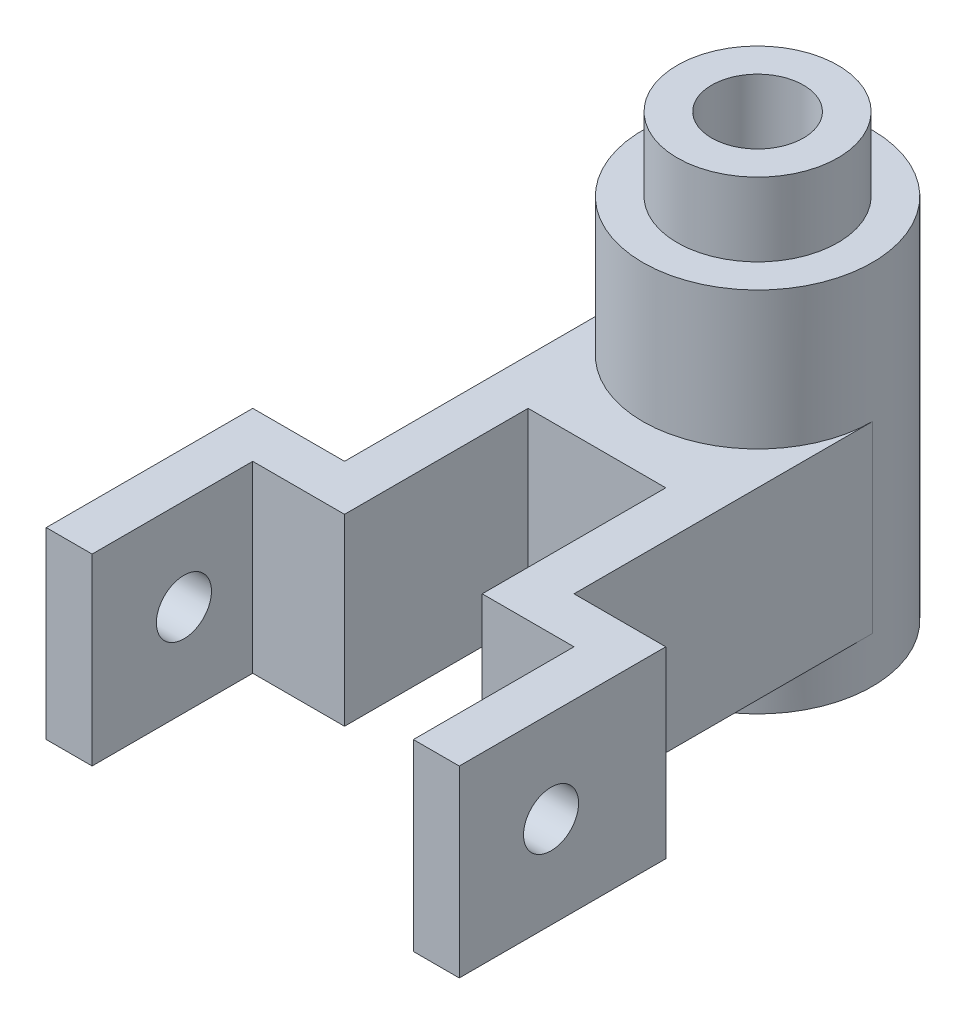
ISO-10303-21;
HEADER;
FILE_DESCRIPTION(('STEP AP214'),'2;1');
FILE_NAME('part.step','',(''),(''),'','','');
FILE_SCHEMA(('AUTOMOTIVE_DESIGN { 1 0 10303 214 1 1 1 1 }'));
ENDSEC;
DATA;
#1=APPLICATION_CONTEXT('core data for automotive mechanical design processes');
#2=APPLICATION_PROTOCOL_DEFINITION('international standard','automotive_design',2000,#1);
#3=PRODUCT_CONTEXT('',#1,'mechanical');
#4=PRODUCT('Part','Part','',(#3));
#5=PRODUCT_RELATED_PRODUCT_CATEGORY('part','',(#4));
#6=PRODUCT_DEFINITION_FORMATION('','',#4);
#7=PRODUCT_DEFINITION_CONTEXT('part definition',#1,'design');
#8=PRODUCT_DEFINITION('design','',#6,#7);
#9=PRODUCT_DEFINITION_SHAPE('','',#8);
#10=(LENGTH_UNIT() NAMED_UNIT(*) SI_UNIT(.MILLI.,.METRE.));
#11=(NAMED_UNIT(*) PLANE_ANGLE_UNIT() SI_UNIT($,.RADIAN.));
#12=(NAMED_UNIT(*) SI_UNIT($,.STERADIAN.) SOLID_ANGLE_UNIT());
#13=UNCERTAINTY_MEASURE_WITH_UNIT(LENGTH_MEASURE(1.E-05),#10,'distance_accuracy_value','');
#14=(GEOMETRIC_REPRESENTATION_CONTEXT(3) GLOBAL_UNCERTAINTY_ASSIGNED_CONTEXT((#13)) GLOBAL_UNIT_ASSIGNED_CONTEXT((#10,
#11,#12)) REPRESENTATION_CONTEXT('',''));
#15=CARTESIAN_POINT('',(0.,0.,0.));
#16=DIRECTION('',(0.,0.,1.));
#17=DIRECTION('',(1.,0.,0.));
#18=AXIS2_PLACEMENT_3D('',#15,#16,#17);
#19=CARTESIAN_POINT('',(0.,80.,0.));
#20=DIRECTION('',(0.,-1.,0.));
#21=DIRECTION('',(0.,0.,-1.));
#22=AXIS2_PLACEMENT_3D('',#19,#20,#21);
#23=CYLINDRICAL_SURFACE('',#22,25.);
#24=DIRECTION('',(0.,-1.,0.));
#25=VECTOR('',#24,1.);
#26=CARTESIAN_POINT('',(-25.,50.,0.));
#27=LINE('',#26,#25);
#28=CARTESIAN_POINT('',(-25.,50.,0.));
#29=VERTEX_POINT('',#28);
#30=CARTESIAN_POINT('',(-25.,9.99999999999999,0.));
#31=VERTEX_POINT('',#30);
#32=EDGE_CURVE('E61',#29,#31,#27,.T.);
#33=ORIENTED_EDGE('',*,*,#32,.F.);
#34=CARTESIAN_POINT('',(0.,50.,0.));
#35=DIRECTION('',(0.,1.,0.));
#36=DIRECTION('',(0.,0.,1.));
#37=AXIS2_PLACEMENT_3D('',#34,#35,#36);
#38=CIRCLE('',#37,25.);
#39=CARTESIAN_POINT('',(25.,50.,0.));
#40=VERTEX_POINT('',#39);
#41=EDGE_CURVE('E56',#29,#40,#38,.T.);
#42=ORIENTED_EDGE('',*,*,#41,.T.);
#43=DIRECTION('',(0.,-1.,0.));
#44=VECTOR('',#43,1.);
#45=CARTESIAN_POINT('',(25.,50.,0.));
#46=LINE('',#45,#44);
#47=CARTESIAN_POINT('',(25.,10.,0.));
#48=VERTEX_POINT('',#47);
#49=EDGE_CURVE('E600',#40,#48,#46,.T.);
#50=ORIENTED_EDGE('',*,*,#49,.T.);
#51=CARTESIAN_POINT('',(0.,10.,0.));
#52=DIRECTION('',(0.,1.,0.));
#53=DIRECTION('',(0.,0.,1.));
#54=AXIS2_PLACEMENT_3D('',#51,#52,#53);
#55=CIRCLE('',#54,25.);
#56=EDGE_CURVE('E534',#31,#48,#55,.T.);
#57=ORIENTED_EDGE('',*,*,#56,.F.);
#58=EDGE_LOOP('',(#33,#42,#50,#57));
#59=FACE_BOUND('',#58,.T.);
#60=CARTESIAN_POINT('',(0.,80.,0.));
#61=DIRECTION('',(0.,1.,0.));
#62=DIRECTION('',(0.,0.,1.));
#63=AXIS2_PLACEMENT_3D('',#60,#61,#62);
#64=CIRCLE('',#63,25.);
#65=CARTESIAN_POINT('',(0.,80.,25.));
#66=VERTEX_POINT('',#65);
#67=EDGE_CURVE('E48',#66,#66,#64,.T.);
#68=ORIENTED_EDGE('',*,*,#67,.F.);
#69=EDGE_LOOP('',(#68));
#70=FACE_BOUND('',#69,.T.);
#71=CARTESIAN_POINT('',(0.,0.,0.));
#72=DIRECTION('',(0.,1.,0.));
#73=DIRECTION('',(0.,0.,1.));
#74=AXIS2_PLACEMENT_3D('',#71,#72,#73);
#75=CIRCLE('',#74,25.);
#76=CARTESIAN_POINT('',(0.,0.,25.));
#77=VERTEX_POINT('',#76);
#78=EDGE_CURVE('E199',#77,#77,#75,.T.);
#79=ORIENTED_EDGE('',*,*,#78,.T.);
#80=EDGE_LOOP('',(#79));
#81=FACE_BOUND('',#80,.T.);
#82=ADVANCED_FACE('F39',(#59,#70,#81),#23,.T.);
#83=CARTESIAN_POINT('',(0.,80.,0.));
#84=DIRECTION('',(0.,1.,0.));
#85=DIRECTION('',(0.,0.,1.));
#86=AXIS2_PLACEMENT_3D('',#83,#84,#85);
#87=PLANE('',#86);
#88=CARTESIAN_POINT('',(0.,80.,0.));
#89=DIRECTION('',(0.,1.,0.));
#90=DIRECTION('',(0.,0.,1.));
#91=AXIS2_PLACEMENT_3D('',#88,#89,#90);
#92=CIRCLE('',#91,17.5);
#93=CARTESIAN_POINT('',(0.,80.,17.5));
#94=VERTEX_POINT('',#93);
#95=EDGE_CURVE('E11',#94,#94,#92,.T.);
#96=ORIENTED_EDGE('',*,*,#95,.F.);
#97=EDGE_LOOP('',(#96));
#98=FACE_BOUND('',#97,.T.);
#99=ORIENTED_EDGE('',*,*,#67,.T.);
#100=EDGE_LOOP('',(#99));
#101=FACE_BOUND('',#100,.T.);
#102=ADVANCED_FACE('F211',(#98,#101),#87,.T.);
#103=CARTESIAN_POINT('',(0.,0.,0.));
#104=DIRECTION('',(0.,1.,0.));
#105=DIRECTION('',(0.,0.,1.));
#106=AXIS2_PLACEMENT_3D('',#103,#104,#105);
#107=PLANE('',#106);
#108=CARTESIAN_POINT('',(0.,0.,0.));
#109=DIRECTION('',(0.,1.,0.));
#110=DIRECTION('',(0.,0.,1.));
#111=AXIS2_PLACEMENT_3D('',#108,#109,#110);
#112=CIRCLE('',#111,10.);
#113=CARTESIAN_POINT('',(0.,0.,10.));
#114=VERTEX_POINT('',#113);
#115=EDGE_CURVE('E187',#114,#114,#112,.T.);
#116=ORIENTED_EDGE('',*,*,#115,.T.);
#117=EDGE_LOOP('',(#116));
#118=FACE_BOUND('',#117,.T.);
#119=ORIENTED_EDGE('',*,*,#78,.F.);
#120=EDGE_LOOP('',(#119));
#121=FACE_BOUND('',#120,.T.);
#122=ADVANCED_FACE('F208',(#118,#121),#107,.F.);
#123=CARTESIAN_POINT('',(0.,96.,0.));
#124=DIRECTION('',(0.,-1.,0.));
#125=DIRECTION('',(0.,0.,-1.));
#126=AXIS2_PLACEMENT_3D('',#123,#124,#125);
#127=CYLINDRICAL_SURFACE('',#126,17.5);
#128=CARTESIAN_POINT('',(0.,96.,0.));
#129=DIRECTION('',(0.,1.,0.));
#130=DIRECTION('',(0.,0.,1.));
#131=AXIS2_PLACEMENT_3D('',#128,#129,#130);
#132=CIRCLE('',#131,17.5);
#133=CARTESIAN_POINT('',(0.,96.,17.5));
#134=VERTEX_POINT('',#133);
#135=EDGE_CURVE('E196',#134,#134,#132,.T.);
#136=ORIENTED_EDGE('',*,*,#135,.F.);
#137=EDGE_LOOP('',(#136));
#138=FACE_BOUND('',#137,.T.);
#139=ORIENTED_EDGE('',*,*,#95,.T.);
#140=EDGE_LOOP('',(#139));
#141=FACE_BOUND('',#140,.T.);
#142=ADVANCED_FACE('F210',(#138,#141),#127,.T.);
#143=CARTESIAN_POINT('',(0.,96.,0.));
#144=DIRECTION('',(0.,1.,0.));
#145=DIRECTION('',(0.,0.,1.));
#146=AXIS2_PLACEMENT_3D('',#143,#144,#145);
#147=PLANE('',#146);
#148=CARTESIAN_POINT('',(0.,96.,0.));
#149=DIRECTION('',(0.,1.,0.));
#150=DIRECTION('',(0.,0.,1.));
#151=AXIS2_PLACEMENT_3D('',#148,#149,#150);
#152=CIRCLE('',#151,10.);
#153=CARTESIAN_POINT('',(0.,96.,10.));
#154=VERTEX_POINT('',#153);
#155=EDGE_CURVE('E182',#154,#154,#152,.T.);
#156=ORIENTED_EDGE('',*,*,#155,.F.);
#157=EDGE_LOOP('',(#156));
#158=FACE_BOUND('',#157,.T.);
#159=ORIENTED_EDGE('',*,*,#135,.T.);
#160=EDGE_LOOP('',(#159));
#161=FACE_BOUND('',#160,.T.);
#162=ADVANCED_FACE('F217',(#158,#161),#147,.T.);
#163=CARTESIAN_POINT('',(0.,-104.,0.));
#164=DIRECTION('',(0.,1.,0.));
#165=DIRECTION('',(0.,0.,1.));
#166=AXIS2_PLACEMENT_3D('',#163,#164,#165);
#167=CYLINDRICAL_SURFACE('',#166,10.);
#168=ORIENTED_EDGE('',*,*,#155,.T.);
#169=EDGE_LOOP('',(#168));
#170=FACE_BOUND('',#169,.T.);
#171=ORIENTED_EDGE('',*,*,#115,.F.);
#172=EDGE_LOOP('',(#171));
#173=FACE_BOUND('',#172,.T.);
#174=ADVANCED_FACE('F252',(#170,#173),#167,.F.);
#175=CARTESIAN_POINT('',(15.,50.,75.));
#176=DIRECTION('',(0.,0.,-1.));
#177=DIRECTION('',(-1.,0.,0.));
#178=AXIS2_PLACEMENT_3D('',#175,#176,#177);
#179=PLANE('',#178);
#180=DIRECTION('',(1.,0.,0.));
#181=VECTOR('',#180,1.);
#182=CARTESIAN_POINT('',(15.,10.,75.));
#183=LINE('',#182,#181);
#184=CARTESIAN_POINT('',(15.,10.,75.));
#185=VERTEX_POINT('',#184);
#186=CARTESIAN_POINT('',(35.,10.,75.));
#187=VERTEX_POINT('',#186);
#188=EDGE_CURVE('E180',#185,#187,#183,.T.);
#189=ORIENTED_EDGE('',*,*,#188,.T.);
#190=DIRECTION('',(0.,-1.,0.));
#191=VECTOR('',#190,1.);
#192=CARTESIAN_POINT('',(35.,50.,75.));
#193=LINE('',#192,#191);
#194=CARTESIAN_POINT('',(35.,50.,75.));
#195=VERTEX_POINT('',#194);
#196=EDGE_CURVE('E158',#195,#187,#193,.T.);
#197=ORIENTED_EDGE('',*,*,#196,.F.);
#198=DIRECTION('',(1.,0.,0.));
#199=VECTOR('',#198,1.);
#200=CARTESIAN_POINT('',(15.,50.,75.));
#201=LINE('',#200,#199);
#202=CARTESIAN_POINT('',(15.,50.,75.));
#203=VERTEX_POINT('',#202);
#204=EDGE_CURVE('E166',#203,#195,#201,.T.);
#205=ORIENTED_EDGE('',*,*,#204,.F.);
#206=DIRECTION('',(0.,-1.,0.));
#207=VECTOR('',#206,1.);
#208=CARTESIAN_POINT('',(15.,50.,75.));
#209=LINE('',#208,#207);
#210=EDGE_CURVE('E514',#203,#185,#209,.T.);
#211=ORIENTED_EDGE('',*,*,#210,.T.);
#212=EDGE_LOOP('',(#189,#197,#205,#211));
#213=FACE_BOUND('',#212,.T.);
#214=ADVANCED_FACE('F178',(#213),#179,.F.);
#215=CARTESIAN_POINT('',(35.,50.,75.));
#216=DIRECTION('',(1.,0.,0.));
#217=DIRECTION('',(0.,0.,-1.));
#218=AXIS2_PLACEMENT_3D('',#215,#216,#217);
#219=PLANE('',#218);
#220=CARTESIAN_POINT('',(35.,30.,90.));
#221=DIRECTION('',(1.,0.,0.));
#222=DIRECTION('',(0.,0.,-1.));
#223=AXIS2_PLACEMENT_3D('',#220,#221,#222);
#224=CIRCLE('',#223,5.99999999999999);
#225=CARTESIAN_POINT('',(35.,30.,84.));
#226=VERTEX_POINT('',#225);
#227=EDGE_CURVE('E458',#226,#226,#224,.T.);
#228=ORIENTED_EDGE('',*,*,#227,.T.);
#229=EDGE_LOOP('',(#228));
#230=FACE_BOUND('',#229,.T.);
#231=DIRECTION('',(0.,0.,1.));
#232=VECTOR('',#231,1.);
#233=CARTESIAN_POINT('',(35.,10.,75.));
#234=LINE('',#233,#232);
#235=CARTESIAN_POINT('',(35.,10.,110.));
#236=VERTEX_POINT('',#235);
#237=EDGE_CURVE('E464',#187,#236,#234,.T.);
#238=ORIENTED_EDGE('',*,*,#237,.T.);
#239=DIRECTION('',(0.,-1.,0.));
#240=VECTOR('',#239,1.);
#241=CARTESIAN_POINT('',(35.,50.,110.));
#242=LINE('',#241,#240);
#243=CARTESIAN_POINT('',(35.,50.,110.));
#244=VERTEX_POINT('',#243);
#245=EDGE_CURVE('E160',#244,#236,#242,.T.);
#246=ORIENTED_EDGE('',*,*,#245,.F.);
#247=DIRECTION('',(0.,0.,1.));
#248=VECTOR('',#247,1.);
#249=CARTESIAN_POINT('',(35.,50.,75.));
#250=LINE('',#249,#248);
#251=EDGE_CURVE('E153',#195,#244,#250,.T.);
#252=ORIENTED_EDGE('',*,*,#251,.F.);
#253=ORIENTED_EDGE('',*,*,#196,.T.);
#254=EDGE_LOOP('',(#238,#246,#252,#253));
#255=FACE_BOUND('',#254,.T.);
#256=ADVANCED_FACE('F156',(#230,#255),#219,.F.);
#257=CARTESIAN_POINT('',(45.,50.,110.));
#258=DIRECTION('',(0.,0.,1.));
#259=DIRECTION('',(1.,0.,0.));
#260=AXIS2_PLACEMENT_3D('',#257,#258,#259);
#261=PLANE('',#260);
#262=DIRECTION('',(-1.,0.,0.));
#263=VECTOR('',#262,1.);
#264=CARTESIAN_POINT('',(45.,10.,110.));
#265=LINE('',#264,#263);
#266=CARTESIAN_POINT('',(45.,10.,110.));
#267=VERTEX_POINT('',#266);
#268=EDGE_CURVE('E518',#267,#236,#265,.T.);
#269=ORIENTED_EDGE('',*,*,#268,.F.);
#270=DIRECTION('',(0.,-1.,0.));
#271=VECTOR('',#270,1.);
#272=CARTESIAN_POINT('',(45.,50.,110.));
#273=LINE('',#272,#271);
#274=CARTESIAN_POINT('',(45.,50.,110.));
#275=VERTEX_POINT('',#274);
#276=EDGE_CURVE('E189',#275,#267,#273,.T.);
#277=ORIENTED_EDGE('',*,*,#276,.F.);
#278=DIRECTION('',(-1.,0.,0.));
#279=VECTOR('',#278,1.);
#280=CARTESIAN_POINT('',(45.,50.,110.));
#281=LINE('',#280,#279);
#282=EDGE_CURVE('E165',#275,#244,#281,.T.);
#283=ORIENTED_EDGE('',*,*,#282,.T.);
#284=ORIENTED_EDGE('',*,*,#245,.T.);
#285=EDGE_LOOP('',(#269,#277,#283,#284));
#286=FACE_BOUND('',#285,.T.);
#287=ADVANCED_FACE('F276',(#286),#261,.T.);
#288=CARTESIAN_POINT('',(45.,50.,65.));
#289=DIRECTION('',(1.,0.,0.));
#290=DIRECTION('',(0.,0.,-1.));
#291=AXIS2_PLACEMENT_3D('',#288,#289,#290);
#292=PLANE('',#291);
#293=CARTESIAN_POINT('',(45.,30.,90.));
#294=DIRECTION('',(1.,0.,0.));
#295=DIRECTION('',(0.,0.,-1.));
#296=AXIS2_PLACEMENT_3D('',#293,#294,#295);
#297=CIRCLE('',#296,5.99999999999999);
#298=CARTESIAN_POINT('',(45.,30.,84.));
#299=VERTEX_POINT('',#298);
#300=EDGE_CURVE('E455',#299,#299,#297,.T.);
#301=ORIENTED_EDGE('',*,*,#300,.F.);
#302=EDGE_LOOP('',(#301));
#303=FACE_BOUND('',#302,.T.);
#304=DIRECTION('',(0.,0.,1.));
#305=VECTOR('',#304,1.);
#306=CARTESIAN_POINT('',(45.,10.,65.));
#307=LINE('',#306,#305);
#308=CARTESIAN_POINT('',(45.,10.,65.));
#309=VERTEX_POINT('',#308);
#310=EDGE_CURVE('E522',#309,#267,#307,.T.);
#311=ORIENTED_EDGE('',*,*,#310,.F.);
#312=DIRECTION('',(0.,-1.,0.));
#313=VECTOR('',#312,1.);
#314=CARTESIAN_POINT('',(45.,50.,65.));
#315=LINE('',#314,#313);
#316=CARTESIAN_POINT('',(45.,50.,65.));
#317=VERTEX_POINT('',#316);
#318=EDGE_CURVE('E606',#317,#309,#315,.T.);
#319=ORIENTED_EDGE('',*,*,#318,.F.);
#320=DIRECTION('',(0.,0.,1.));
#321=VECTOR('',#320,1.);
#322=CARTESIAN_POINT('',(45.,50.,65.));
#323=LINE('',#322,#321);
#324=EDGE_CURVE('E472',#317,#275,#323,.T.);
#325=ORIENTED_EDGE('',*,*,#324,.T.);
#326=ORIENTED_EDGE('',*,*,#276,.T.);
#327=EDGE_LOOP('',(#311,#319,#325,#326));
#328=FACE_BOUND('',#327,.T.);
#329=ADVANCED_FACE('F285',(#303,#328),#292,.T.);
#330=CARTESIAN_POINT('',(25.,50.,65.));
#331=DIRECTION('',(0.,0.,-1.));
#332=DIRECTION('',(-1.,0.,0.));
#333=AXIS2_PLACEMENT_3D('',#330,#331,#332);
#334=PLANE('',#333);
#335=DIRECTION('',(1.,0.,0.));
#336=VECTOR('',#335,1.);
#337=CARTESIAN_POINT('',(25.,10.,65.));
#338=LINE('',#337,#336);
#339=CARTESIAN_POINT('',(25.,10.,65.));
#340=VERTEX_POINT('',#339);
#341=EDGE_CURVE('E526',#340,#309,#338,.T.);
#342=ORIENTED_EDGE('',*,*,#341,.F.);
#343=DIRECTION('',(0.,-1.,0.));
#344=VECTOR('',#343,1.);
#345=CARTESIAN_POINT('',(25.,50.,65.));
#346=LINE('',#345,#344);
#347=CARTESIAN_POINT('',(25.,50.,65.));
#348=VERTEX_POINT('',#347);
#349=EDGE_CURVE('E603',#348,#340,#346,.T.);
#350=ORIENTED_EDGE('',*,*,#349,.F.);
#351=DIRECTION('',(1.,0.,0.));
#352=VECTOR('',#351,1.);
#353=CARTESIAN_POINT('',(25.,50.,65.));
#354=LINE('',#353,#352);
#355=EDGE_CURVE('E476',#348,#317,#354,.T.);
#356=ORIENTED_EDGE('',*,*,#355,.T.);
#357=ORIENTED_EDGE('',*,*,#318,.T.);
#358=EDGE_LOOP('',(#342,#350,#356,#357));
#359=FACE_BOUND('',#358,.T.);
#360=ADVANCED_FACE('F293',(#359),#334,.T.);
#361=CARTESIAN_POINT('',(25.,50.,0.));
#362=DIRECTION('',(1.,0.,0.));
#363=DIRECTION('',(0.,0.,-1.));
#364=AXIS2_PLACEMENT_3D('',#361,#362,#363);
#365=PLANE('',#364);
#366=DIRECTION('',(0.,0.,1.));
#367=VECTOR('',#366,1.);
#368=CARTESIAN_POINT('',(25.,10.,0.));
#369=LINE('',#368,#367);
#370=EDGE_CURVE('E530',#48,#340,#369,.T.);
#371=ORIENTED_EDGE('',*,*,#370,.F.);
#372=ORIENTED_EDGE('',*,*,#49,.F.);
#373=DIRECTION('',(0.,0.,1.));
#374=VECTOR('',#373,1.);
#375=CARTESIAN_POINT('',(25.,50.,0.));
#376=LINE('',#375,#374);
#377=EDGE_CURVE('E480',#40,#348,#376,.T.);
#378=ORIENTED_EDGE('',*,*,#377,.T.);
#379=ORIENTED_EDGE('',*,*,#349,.T.);
#380=EDGE_LOOP('',(#371,#372,#378,#379));
#381=FACE_BOUND('',#380,.T.);
#382=ADVANCED_FACE('F301',(#381),#365,.T.);
#383=CARTESIAN_POINT('',(-25.,50.,0.));
#384=DIRECTION('',(1.,0.,0.));
#385=DIRECTION('',(0.,0.,-1.));
#386=AXIS2_PLACEMENT_3D('',#383,#384,#385);
#387=PLANE('',#386);
#388=DIRECTION('',(0.,0.,1.));
#389=VECTOR('',#388,1.);
#390=CARTESIAN_POINT('',(-25.,10.,0.));
#391=LINE('',#390,#389);
#392=CARTESIAN_POINT('',(-25.,10.,65.));
#393=VERTEX_POINT('',#392);
#394=EDGE_CURVE('E538',#31,#393,#391,.T.);
#395=ORIENTED_EDGE('',*,*,#394,.T.);
#396=DIRECTION('',(0.,-1.,0.));
#397=VECTOR('',#396,1.);
#398=CARTESIAN_POINT('',(-25.,50.,65.));
#399=LINE('',#398,#397);
#400=CARTESIAN_POINT('',(-25.,50.,65.));
#401=VERTEX_POINT('',#400);
#402=EDGE_CURVE('E594',#401,#393,#399,.T.);
#403=ORIENTED_EDGE('',*,*,#402,.F.);
#404=DIRECTION('',(0.,0.,1.));
#405=VECTOR('',#404,1.);
#406=CARTESIAN_POINT('',(-25.,50.,0.));
#407=LINE('',#406,#405);
#408=EDGE_CURVE('E486',#29,#401,#407,.T.);
#409=ORIENTED_EDGE('',*,*,#408,.F.);
#410=ORIENTED_EDGE('',*,*,#32,.T.);
#411=EDGE_LOOP('',(#395,#403,#409,#410));
#412=FACE_BOUND('',#411,.T.);
#413=ADVANCED_FACE('F309',(#412),#387,.F.);
#414=CARTESIAN_POINT('',(-25.,50.,65.));
#415=DIRECTION('',(0.,0.,1.));
#416=DIRECTION('',(1.,0.,0.));
#417=AXIS2_PLACEMENT_3D('',#414,#415,#416);
#418=PLANE('',#417);
#419=DIRECTION('',(-1.,0.,0.));
#420=VECTOR('',#419,1.);
#421=CARTESIAN_POINT('',(-25.,10.,65.));
#422=LINE('',#421,#420);
#423=CARTESIAN_POINT('',(-45.,10.,65.));
#424=VERTEX_POINT('',#423);
#425=EDGE_CURVE('E541',#393,#424,#422,.T.);
#426=ORIENTED_EDGE('',*,*,#425,.T.);
#427=DIRECTION('',(0.,-1.,0.));
#428=VECTOR('',#427,1.);
#429=CARTESIAN_POINT('',(-45.,50.,65.));
#430=LINE('',#429,#428);
#431=CARTESIAN_POINT('',(-45.,50.,65.));
#432=VERTEX_POINT('',#431);
#433=EDGE_CURVE('E590',#432,#424,#430,.T.);
#434=ORIENTED_EDGE('',*,*,#433,.F.);
#435=DIRECTION('',(-1.,0.,0.));
#436=VECTOR('',#435,1.);
#437=CARTESIAN_POINT('',(-25.,50.,65.));
#438=LINE('',#437,#436);
#439=EDGE_CURVE('E489',#401,#432,#438,.T.);
#440=ORIENTED_EDGE('',*,*,#439,.F.);
#441=ORIENTED_EDGE('',*,*,#402,.T.);
#442=EDGE_LOOP('',(#426,#434,#440,#441));
#443=FACE_BOUND('',#442,.T.);
#444=ADVANCED_FACE('F317',(#443),#418,.F.);
#445=CARTESIAN_POINT('',(-45.,50.,65.));
#446=DIRECTION('',(1.,0.,0.));
#447=DIRECTION('',(0.,0.,-1.));
#448=AXIS2_PLACEMENT_3D('',#445,#446,#447);
#449=PLANE('',#448);
#450=CARTESIAN_POINT('',(-45.,30.,90.));
#451=DIRECTION('',(1.,0.,0.));
#452=DIRECTION('',(0.,0.,-1.));
#453=AXIS2_PLACEMENT_3D('',#450,#451,#452);
#454=CIRCLE('',#453,5.99999999999999);
#455=CARTESIAN_POINT('',(-45.,30.,84.));
#456=VERTEX_POINT('',#455);
#457=EDGE_CURVE('E460',#456,#456,#454,.T.);
#458=ORIENTED_EDGE('',*,*,#457,.T.);
#459=EDGE_LOOP('',(#458));
#460=FACE_BOUND('',#459,.T.);
#461=DIRECTION('',(0.,0.,1.));
#462=VECTOR('',#461,1.);
#463=CARTESIAN_POINT('',(-45.,10.,65.));
#464=LINE('',#463,#462);
#465=CARTESIAN_POINT('',(-45.,10.,110.));
#466=VERTEX_POINT('',#465);
#467=EDGE_CURVE('E544',#424,#466,#464,.T.);
#468=ORIENTED_EDGE('',*,*,#467,.T.);
#469=DIRECTION('',(0.,-1.,0.));
#470=VECTOR('',#469,1.);
#471=CARTESIAN_POINT('',(-45.,50.,110.));
#472=LINE('',#471,#470);
#473=CARTESIAN_POINT('',(-45.,50.,110.));
#474=VERTEX_POINT('',#473);
#475=EDGE_CURVE('E586',#474,#466,#472,.T.);
#476=ORIENTED_EDGE('',*,*,#475,.F.);
#477=DIRECTION('',(0.,0.,1.));
#478=VECTOR('',#477,1.);
#479=CARTESIAN_POINT('',(-45.,50.,65.));
#480=LINE('',#479,#478);
#481=EDGE_CURVE('E492',#432,#474,#480,.T.);
#482=ORIENTED_EDGE('',*,*,#481,.F.);
#483=ORIENTED_EDGE('',*,*,#433,.T.);
#484=EDGE_LOOP('',(#468,#476,#482,#483));
#485=FACE_BOUND('',#484,.T.);
#486=ADVANCED_FACE('F325',(#460,#485),#449,.F.);
#487=CARTESIAN_POINT('',(-45.,50.,110.));
#488=DIRECTION('',(0.,0.,-1.));
#489=DIRECTION('',(-1.,0.,0.));
#490=AXIS2_PLACEMENT_3D('',#487,#488,#489);
#491=PLANE('',#490);
#492=DIRECTION('',(1.,0.,0.));
#493=VECTOR('',#492,1.);
#494=CARTESIAN_POINT('',(-45.,10.,110.));
#495=LINE('',#494,#493);
#496=CARTESIAN_POINT('',(-35.,10.,110.));
#497=VERTEX_POINT('',#496);
#498=EDGE_CURVE('E547',#466,#497,#495,.T.);
#499=ORIENTED_EDGE('',*,*,#498,.T.);
#500=DIRECTION('',(0.,-1.,0.));
#501=VECTOR('',#500,1.);
#502=CARTESIAN_POINT('',(-35.,50.,110.));
#503=LINE('',#502,#501);
#504=CARTESIAN_POINT('',(-35.,50.,110.));
#505=VERTEX_POINT('',#504);
#506=EDGE_CURVE('E583',#505,#497,#503,.T.);
#507=ORIENTED_EDGE('',*,*,#506,.F.);
#508=DIRECTION('',(1.,0.,0.));
#509=VECTOR('',#508,1.);
#510=CARTESIAN_POINT('',(-45.,50.,110.));
#511=LINE('',#510,#509);
#512=EDGE_CURVE('E495',#474,#505,#511,.T.);
#513=ORIENTED_EDGE('',*,*,#512,.F.);
#514=ORIENTED_EDGE('',*,*,#475,.T.);
#515=EDGE_LOOP('',(#499,#507,#513,#514));
#516=FACE_BOUND('',#515,.T.);
#517=ADVANCED_FACE('F333',(#516),#491,.F.);
#518=CARTESIAN_POINT('',(-35.,50.,75.));
#519=DIRECTION('',(1.,0.,0.));
#520=DIRECTION('',(0.,0.,-1.));
#521=AXIS2_PLACEMENT_3D('',#518,#519,#520);
#522=PLANE('',#521);
#523=CARTESIAN_POINT('',(-35.,30.,90.));
#524=DIRECTION('',(1.,0.,0.));
#525=DIRECTION('',(0.,0.,-1.));
#526=AXIS2_PLACEMENT_3D('',#523,#524,#525);
#527=CIRCLE('',#526,5.99999999999999);
#528=CARTESIAN_POINT('',(-35.,30.,84.));
#529=VERTEX_POINT('',#528);
#530=EDGE_CURVE('E42',#529,#529,#527,.T.);
#531=ORIENTED_EDGE('',*,*,#530,.F.);
#532=EDGE_LOOP('',(#531));
#533=FACE_BOUND('',#532,.T.);
#534=DIRECTION('',(0.,0.,1.));
#535=VECTOR('',#534,1.);
#536=CARTESIAN_POINT('',(-35.,10.,75.));
#537=LINE('',#536,#535);
#538=CARTESIAN_POINT('',(-35.,10.,75.));
#539=VERTEX_POINT('',#538);
#540=EDGE_CURVE('E551',#539,#497,#537,.T.);
#541=ORIENTED_EDGE('',*,*,#540,.F.);
#542=DIRECTION('',(0.,-1.,0.));
#543=VECTOR('',#542,1.);
#544=CARTESIAN_POINT('',(-35.,50.,75.));
#545=LINE('',#544,#543);
#546=CARTESIAN_POINT('',(-35.,50.,75.));
#547=VERTEX_POINT('',#546);
#548=EDGE_CURVE('E580',#547,#539,#545,.T.);
#549=ORIENTED_EDGE('',*,*,#548,.F.);
#550=DIRECTION('',(0.,0.,1.));
#551=VECTOR('',#550,1.);
#552=CARTESIAN_POINT('',(-35.,50.,75.));
#553=LINE('',#552,#551);
#554=EDGE_CURVE('E498',#547,#505,#553,.T.);
#555=ORIENTED_EDGE('',*,*,#554,.T.);
#556=ORIENTED_EDGE('',*,*,#506,.T.);
#557=EDGE_LOOP('',(#541,#549,#555,#556));
#558=FACE_BOUND('',#557,.T.);
#559=ADVANCED_FACE('F341',(#533,#558),#522,.T.);
#560=CARTESIAN_POINT('',(-15.,50.,75.));
#561=DIRECTION('',(0.,0.,1.));
#562=DIRECTION('',(1.,0.,0.));
#563=AXIS2_PLACEMENT_3D('',#560,#561,#562);
#564=PLANE('',#563);
#565=DIRECTION('',(-1.,0.,0.));
#566=VECTOR('',#565,1.);
#567=CARTESIAN_POINT('',(-15.,10.,75.));
#568=LINE('',#567,#566);
#569=CARTESIAN_POINT('',(-15.,10.,75.));
#570=VERTEX_POINT('',#569);
#571=EDGE_CURVE('E555',#570,#539,#568,.T.);
#572=ORIENTED_EDGE('',*,*,#571,.F.);
#573=DIRECTION('',(0.,-1.,0.));
#574=VECTOR('',#573,1.);
#575=CARTESIAN_POINT('',(-15.,50.,75.));
#576=LINE('',#575,#574);
#577=CARTESIAN_POINT('',(-15.,50.,75.));
#578=VERTEX_POINT('',#577);
#579=EDGE_CURVE('E577',#578,#570,#576,.T.);
#580=ORIENTED_EDGE('',*,*,#579,.F.);
#581=DIRECTION('',(-1.,0.,0.));
#582=VECTOR('',#581,1.);
#583=CARTESIAN_POINT('',(-15.,50.,75.));
#584=LINE('',#583,#582);
#585=EDGE_CURVE('E502',#578,#547,#584,.T.);
#586=ORIENTED_EDGE('',*,*,#585,.T.);
#587=ORIENTED_EDGE('',*,*,#548,.T.);
#588=EDGE_LOOP('',(#572,#580,#586,#587));
#589=FACE_BOUND('',#588,.T.);
#590=ADVANCED_FACE('F349',(#589),#564,.T.);
#591=CARTESIAN_POINT('',(-15.,50.,35.));
#592=DIRECTION('',(1.,0.,0.));
#593=DIRECTION('',(0.,0.,-1.));
#594=AXIS2_PLACEMENT_3D('',#591,#592,#593);
#595=PLANE('',#594);
#596=DIRECTION('',(0.,0.,1.));
#597=VECTOR('',#596,1.);
#598=CARTESIAN_POINT('',(-15.,10.,35.));
#599=LINE('',#598,#597);
#600=CARTESIAN_POINT('',(-15.,10.,35.));
#601=VERTEX_POINT('',#600);
#602=EDGE_CURVE('E559',#601,#570,#599,.T.);
#603=ORIENTED_EDGE('',*,*,#602,.F.);
#604=DIRECTION('',(0.,-1.,0.));
#605=VECTOR('',#604,1.);
#606=CARTESIAN_POINT('',(-15.,50.,35.));
#607=LINE('',#606,#605);
#608=CARTESIAN_POINT('',(-15.,50.,35.));
#609=VERTEX_POINT('',#608);
#610=EDGE_CURVE('E573',#609,#601,#607,.T.);
#611=ORIENTED_EDGE('',*,*,#610,.F.);
#612=DIRECTION('',(0.,0.,1.));
#613=VECTOR('',#612,1.);
#614=CARTESIAN_POINT('',(-15.,50.,35.));
#615=LINE('',#614,#613);
#616=EDGE_CURVE('E506',#609,#578,#615,.T.);
#617=ORIENTED_EDGE('',*,*,#616,.T.);
#618=ORIENTED_EDGE('',*,*,#579,.T.);
#619=EDGE_LOOP('',(#603,#611,#617,#618));
#620=FACE_BOUND('',#619,.T.);
#621=ADVANCED_FACE('F357',(#620),#595,.T.);
#622=CARTESIAN_POINT('',(15.,50.,35.));
#623=DIRECTION('',(0.,0.,1.));
#624=DIRECTION('',(1.,0.,0.));
#625=AXIS2_PLACEMENT_3D('',#622,#623,#624);
#626=PLANE('',#625);
#627=DIRECTION('',(-1.,0.,0.));
#628=VECTOR('',#627,1.);
#629=CARTESIAN_POINT('',(15.,10.,35.));
#630=LINE('',#629,#628);
#631=CARTESIAN_POINT('',(15.,10.,35.));
#632=VERTEX_POINT('',#631);
#633=EDGE_CURVE('E563',#632,#601,#630,.T.);
#634=ORIENTED_EDGE('',*,*,#633,.F.);
#635=DIRECTION('',(0.,-1.,0.));
#636=VECTOR('',#635,1.);
#637=CARTESIAN_POINT('',(15.,50.,35.));
#638=LINE('',#637,#636);
#639=CARTESIAN_POINT('',(15.,50.,35.));
#640=VERTEX_POINT('',#639);
#641=EDGE_CURVE('E570',#640,#632,#638,.T.);
#642=ORIENTED_EDGE('',*,*,#641,.F.);
#643=DIRECTION('',(1.,0.,0.));
#644=VECTOR('',#643,1.);
#645=CARTESIAN_POINT('',(-15.,50.,35.));
#646=LINE('',#645,#644);
#647=EDGE_CURVE('E510',#609,#640,#646,.T.);
#648=ORIENTED_EDGE('',*,*,#647,.F.);
#649=ORIENTED_EDGE('',*,*,#610,.T.);
#650=EDGE_LOOP('',(#634,#642,#648,#649));
#651=FACE_BOUND('',#650,.T.);
#652=ADVANCED_FACE('F365',(#651),#626,.T.);
#653=CARTESIAN_POINT('',(15.,50.,35.));
#654=DIRECTION('',(1.,0.,0.));
#655=DIRECTION('',(0.,0.,-1.));
#656=AXIS2_PLACEMENT_3D('',#653,#654,#655);
#657=PLANE('',#656);
#658=DIRECTION('',(0.,0.,1.));
#659=VECTOR('',#658,1.);
#660=CARTESIAN_POINT('',(15.,10.,35.));
#661=LINE('',#660,#659);
#662=EDGE_CURVE('E176',#632,#185,#661,.T.);
#663=ORIENTED_EDGE('',*,*,#662,.T.);
#664=ORIENTED_EDGE('',*,*,#210,.F.);
#665=DIRECTION('',(0.,0.,1.));
#666=VECTOR('',#665,1.);
#667=CARTESIAN_POINT('',(15.,50.,35.));
#668=LINE('',#667,#666);
#669=EDGE_CURVE('E171',#640,#203,#668,.T.);
#670=ORIENTED_EDGE('',*,*,#669,.F.);
#671=ORIENTED_EDGE('',*,*,#641,.T.);
#672=EDGE_LOOP('',(#663,#664,#670,#671));
#673=FACE_BOUND('',#672,.T.);
#674=ADVANCED_FACE('F373',(#673),#657,.F.);
#675=CARTESIAN_POINT('',(0.,50.,0.));
#676=DIRECTION('',(0.,1.,0.));
#677=DIRECTION('',(0.,0.,1.));
#678=AXIS2_PLACEMENT_3D('',#675,#676,#677);
#679=PLANE('',#678);
#680=ORIENTED_EDGE('',*,*,#204,.T.);
#681=ORIENTED_EDGE('',*,*,#251,.T.);
#682=ORIENTED_EDGE('',*,*,#282,.F.);
#683=ORIENTED_EDGE('',*,*,#324,.F.);
#684=ORIENTED_EDGE('',*,*,#355,.F.);
#685=ORIENTED_EDGE('',*,*,#377,.F.);
#686=ORIENTED_EDGE('',*,*,#41,.F.);
#687=ORIENTED_EDGE('',*,*,#408,.T.);
#688=ORIENTED_EDGE('',*,*,#439,.T.);
#689=ORIENTED_EDGE('',*,*,#481,.T.);
#690=ORIENTED_EDGE('',*,*,#512,.T.);
#691=ORIENTED_EDGE('',*,*,#554,.F.);
#692=ORIENTED_EDGE('',*,*,#585,.F.);
#693=ORIENTED_EDGE('',*,*,#616,.F.);
#694=ORIENTED_EDGE('',*,*,#647,.T.);
#695=ORIENTED_EDGE('',*,*,#669,.T.);
#696=EDGE_LOOP('',(#680,#681,#682,#683,#684,#685,#686,#687,#688,#689,#690,#691,#692,#693,#694,#695));
#697=FACE_BOUND('',#696,.T.);
#698=ADVANCED_FACE('F169',(#697),#679,.T.);
#699=CARTESIAN_POINT('',(0.,10.,0.));
#700=DIRECTION('',(0.,1.,0.));
#701=DIRECTION('',(0.,0.,1.));
#702=AXIS2_PLACEMENT_3D('',#699,#700,#701);
#703=PLANE('',#702);
#704=ORIENTED_EDGE('',*,*,#188,.F.);
#705=ORIENTED_EDGE('',*,*,#662,.F.);
#706=ORIENTED_EDGE('',*,*,#633,.T.);
#707=ORIENTED_EDGE('',*,*,#602,.T.);
#708=ORIENTED_EDGE('',*,*,#571,.T.);
#709=ORIENTED_EDGE('',*,*,#540,.T.);
#710=ORIENTED_EDGE('',*,*,#498,.F.);
#711=ORIENTED_EDGE('',*,*,#467,.F.);
#712=ORIENTED_EDGE('',*,*,#425,.F.);
#713=ORIENTED_EDGE('',*,*,#394,.F.);
#714=ORIENTED_EDGE('',*,*,#56,.T.);
#715=ORIENTED_EDGE('',*,*,#370,.T.);
#716=ORIENTED_EDGE('',*,*,#341,.T.);
#717=ORIENTED_EDGE('',*,*,#310,.T.);
#718=ORIENTED_EDGE('',*,*,#268,.T.);
#719=ORIENTED_EDGE('',*,*,#237,.F.);
#720=EDGE_LOOP('',(#704,#705,#706,#707,#708,#709,#710,#711,#712,#713,#714,#715,#716,#717,#718,#719));
#721=FACE_BOUND('',#720,.T.);
#722=ADVANCED_FACE('F388',(#721),#703,.F.);
#723=CARTESIAN_POINT('',(-55.,30.,90.));
#724=DIRECTION('',(1.,0.,0.));
#725=DIRECTION('',(0.,0.,-1.));
#726=AXIS2_PLACEMENT_3D('',#723,#724,#725);
#727=CYLINDRICAL_SURFACE('',#726,5.99999999999999);
#728=ORIENTED_EDGE('',*,*,#530,.T.);
#729=EDGE_LOOP('',(#728));
#730=FACE_BOUND('',#729,.T.);
#731=ORIENTED_EDGE('',*,*,#457,.F.);
#732=EDGE_LOOP('',(#731));
#733=FACE_BOUND('',#732,.T.);
#734=ADVANCED_FACE('F394',(#730,#733),#727,.F.);
#735=ORIENTED_EDGE('',*,*,#300,.T.);
#736=EDGE_LOOP('',(#735));
#737=FACE_BOUND('',#736,.T.);
#738=ORIENTED_EDGE('',*,*,#227,.F.);
#739=EDGE_LOOP('',(#738));
#740=FACE_BOUND('',#739,.T.);
#741=ADVANCED_FACE('F401',(#737,#740),#727,.F.);
#742=CLOSED_SHELL('',(#82,#102,#122,#142,#162,#174,#214,#256,#287,#329,#360,#382,#413,#444,#486,
#517,#559,#590,#621,#652,#674,#698,#722,#734,#741));
#743=MANIFOLD_SOLID_BREP('B2',#742);
#744=ADVANCED_BREP_SHAPE_REPRESENTATION('',(#18,#743),#14);
#745=SHAPE_DEFINITION_REPRESENTATION(#9,#744);
ENDSEC;
END-ISO-10303-21;
